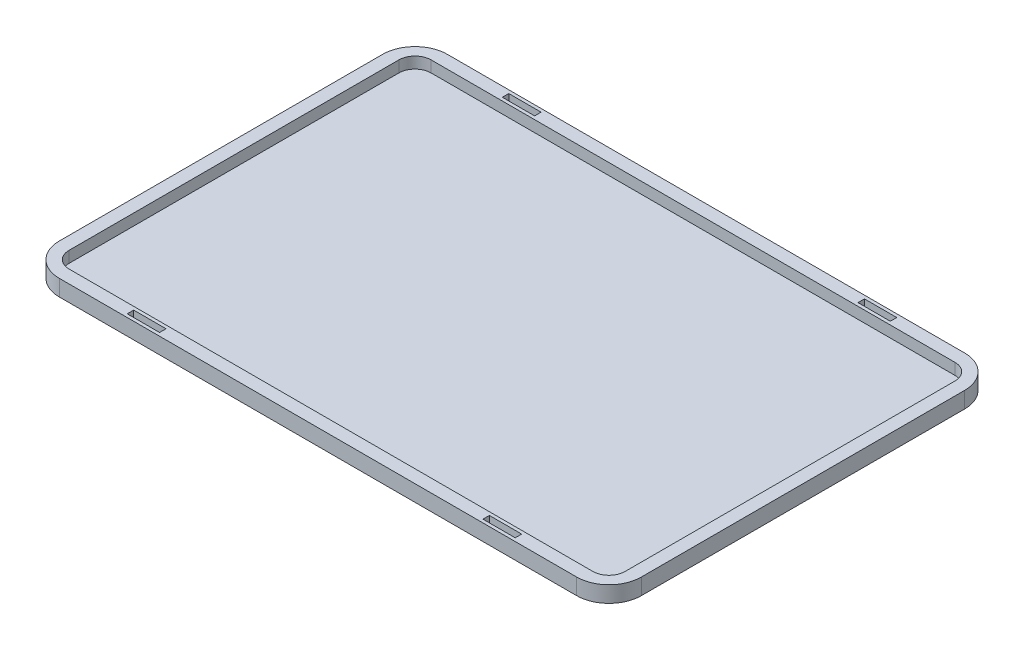
ISO-10303-21;
HEADER;
FILE_DESCRIPTION(('STEP AP214'),'2;1');
FILE_NAME('part.step','',(''),(''),'','','');
FILE_SCHEMA(('AUTOMOTIVE_DESIGN { 1 0 10303 214 1 1 1 1 }'));
ENDSEC;
DATA;
#1=APPLICATION_CONTEXT('core data for automotive mechanical design processes');
#2=APPLICATION_PROTOCOL_DEFINITION('international standard','automotive_design',2000,#1);
#3=PRODUCT_CONTEXT('',#1,'mechanical');
#4=PRODUCT('Part','Part','',(#3));
#5=PRODUCT_RELATED_PRODUCT_CATEGORY('part','',(#4));
#6=PRODUCT_DEFINITION_FORMATION('','',#4);
#7=PRODUCT_DEFINITION_CONTEXT('part definition',#1,'design');
#8=PRODUCT_DEFINITION('design','',#6,#7);
#9=PRODUCT_DEFINITION_SHAPE('','',#8);
#10=(LENGTH_UNIT() NAMED_UNIT(*) SI_UNIT(.MILLI.,.METRE.));
#11=(NAMED_UNIT(*) PLANE_ANGLE_UNIT() SI_UNIT($,.RADIAN.));
#12=(NAMED_UNIT(*) SI_UNIT($,.STERADIAN.) SOLID_ANGLE_UNIT());
#13=UNCERTAINTY_MEASURE_WITH_UNIT(LENGTH_MEASURE(1.E-05),#10,'distance_accuracy_value','');
#14=(GEOMETRIC_REPRESENTATION_CONTEXT(3) GLOBAL_UNCERTAINTY_ASSIGNED_CONTEXT((#13)) GLOBAL_UNIT_ASSIGNED_CONTEXT((#10,
#11,#12)) REPRESENTATION_CONTEXT('',''));
#15=CARTESIAN_POINT('',(0.,0.,0.));
#16=DIRECTION('',(0.,0.,1.));
#17=DIRECTION('',(1.,0.,0.));
#18=AXIS2_PLACEMENT_3D('',#15,#16,#17);
#19=CARTESIAN_POINT('',(0.,5.,0.));
#20=DIRECTION('',(0.,-1.,0.));
#21=DIRECTION('',(0.,0.,-1.));
#22=AXIS2_PLACEMENT_3D('',#19,#20,#21);
#23=PLANE('',#22);
#24=DIRECTION('',(0.,0.,1.));
#25=VECTOR('',#24,1.);
#26=CARTESIAN_POINT('',(50.,5.,0.));
#27=LINE('',#26,#25);
#28=CARTESIAN_POINT('',(50.,5.,57.));
#29=VERTEX_POINT('',#28);
#30=CARTESIAN_POINT('',(50.,5.,59.));
#31=VERTEX_POINT('',#30);
#32=EDGE_CURVE('E360',#29,#31,#27,.T.);
#33=ORIENTED_EDGE('',*,*,#32,.F.);
#34=DIRECTION('',(-1.,0.,0.));
#35=VECTOR('',#34,1.);
#36=CARTESIAN_POINT('',(0.,5.,57.));
#37=LINE('',#36,#35);
#38=CARTESIAN_POINT('',(60.,5.,57.));
#39=VERTEX_POINT('',#38);
#40=EDGE_CURVE('E354',#39,#29,#37,.T.);
#41=ORIENTED_EDGE('',*,*,#40,.F.);
#42=DIRECTION('',(0.,0.,-1.));
#43=VECTOR('',#42,1.);
#44=CARTESIAN_POINT('',(60.,5.,0.));
#45=LINE('',#44,#43);
#46=CARTESIAN_POINT('',(60.,5.,59.));
#47=VERTEX_POINT('',#46);
#48=EDGE_CURVE('E356',#47,#39,#45,.T.);
#49=ORIENTED_EDGE('',*,*,#48,.F.);
#50=DIRECTION('',(1.,0.,0.));
#51=VECTOR('',#50,1.);
#52=CARTESIAN_POINT('',(0.,5.,59.));
#53=LINE('',#52,#51);
#54=EDGE_CURVE('E358',#31,#47,#53,.T.);
#55=ORIENTED_EDGE('',*,*,#54,.F.);
#56=EDGE_LOOP('',(#33,#41,#49,#55));
#57=FACE_BOUND('',#56,.T.);
#58=DIRECTION('',(0.,0.,1.));
#59=VECTOR('',#58,1.);
#60=CARTESIAN_POINT('',(-60.,5.,0.));
#61=LINE('',#60,#59);
#62=CARTESIAN_POINT('',(-60.,5.,-59.));
#63=VERTEX_POINT('',#62);
#64=CARTESIAN_POINT('',(-60.,5.,-57.));
#65=VERTEX_POINT('',#64);
#66=EDGE_CURVE('E344',#63,#65,#61,.T.);
#67=ORIENTED_EDGE('',*,*,#66,.F.);
#68=DIRECTION('',(-1.,0.,0.));
#69=VECTOR('',#68,1.);
#70=CARTESIAN_POINT('',(0.,5.,-59.));
#71=LINE('',#70,#69);
#72=CARTESIAN_POINT('',(-50.,5.,-59.));
#73=VERTEX_POINT('',#72);
#74=EDGE_CURVE('E337',#73,#63,#71,.T.);
#75=ORIENTED_EDGE('',*,*,#74,.F.);
#76=DIRECTION('',(0.,0.,-1.));
#77=VECTOR('',#76,1.);
#78=CARTESIAN_POINT('',(-50.,5.,0.));
#79=LINE('',#78,#77);
#80=CARTESIAN_POINT('',(-50.,5.,-57.));
#81=VERTEX_POINT('',#80);
#82=EDGE_CURVE('E339',#81,#73,#79,.T.);
#83=ORIENTED_EDGE('',*,*,#82,.F.);
#84=DIRECTION('',(1.,0.,0.));
#85=VECTOR('',#84,1.);
#86=CARTESIAN_POINT('',(0.,5.,-57.));
#87=LINE('',#86,#85);
#88=EDGE_CURVE('E342',#65,#81,#87,.T.);
#89=ORIENTED_EDGE('',*,*,#88,.F.);
#90=EDGE_LOOP('',(#67,#75,#83,#89));
#91=FACE_BOUND('',#90,.T.);
#92=DIRECTION('',(0.,0.,-1.));
#93=VECTOR('',#92,1.);
#94=CARTESIAN_POINT('',(86.,5.,0.));
#95=LINE('',#94,#93);
#96=CARTESIAN_POINT('',(86.,5.,51.));
#97=VERTEX_POINT('',#96);
#98=CARTESIAN_POINT('',(86.,5.,-51.));
#99=VERTEX_POINT('',#98);
#100=EDGE_CURVE('E380',#97,#99,#95,.T.);
#101=ORIENTED_EDGE('',*,*,#100,.F.);
#102=CARTESIAN_POINT('',(81.,5.,51.));
#103=DIRECTION('',(0.,-1.,0.));
#104=DIRECTION('',(0.,0.,-1.));
#105=AXIS2_PLACEMENT_3D('',#102,#103,#104);
#106=CIRCLE('',#105,5.);
#107=CARTESIAN_POINT('',(81.,5.,56.));
#108=VERTEX_POINT('',#107);
#109=EDGE_CURVE('E11',#108,#97,#106,.F.);
#110=ORIENTED_EDGE('',*,*,#109,.F.);
#111=DIRECTION('',(1.,0.,0.));
#112=VECTOR('',#111,1.);
#113=CARTESIAN_POINT('',(0.,5.,56.));
#114=LINE('',#113,#112);
#115=CARTESIAN_POINT('',(-81.,5.,56.));
#116=VERTEX_POINT('',#115);
#117=EDGE_CURVE('E384',#116,#108,#114,.T.);
#118=ORIENTED_EDGE('',*,*,#117,.F.);
#119=CARTESIAN_POINT('',(-81.,5.,51.));
#120=DIRECTION('',(0.,-1.,0.));
#121=DIRECTION('',(0.,0.,-1.));
#122=AXIS2_PLACEMENT_3D('',#119,#120,#121);
#123=CIRCLE('',#122,5.);
#124=CARTESIAN_POINT('',(-86.,5.,51.));
#125=VERTEX_POINT('',#124);
#126=EDGE_CURVE('E481',#125,#116,#123,.F.);
#127=ORIENTED_EDGE('',*,*,#126,.F.);
#128=DIRECTION('',(0.,0.,1.));
#129=VECTOR('',#128,1.);
#130=CARTESIAN_POINT('',(-86.,5.,0.));
#131=LINE('',#130,#129);
#132=CARTESIAN_POINT('',(-86.,5.,-51.));
#133=VERTEX_POINT('',#132);
#134=EDGE_CURVE('E381',#133,#125,#131,.T.);
#135=ORIENTED_EDGE('',*,*,#134,.F.);
#136=CARTESIAN_POINT('',(-81.,5.,-51.));
#137=DIRECTION('',(0.,-1.,0.));
#138=DIRECTION('',(0.,0.,-1.));
#139=AXIS2_PLACEMENT_3D('',#136,#137,#138);
#140=CIRCLE('',#139,5.);
#141=CARTESIAN_POINT('',(-81.,5.,-56.));
#142=VERTEX_POINT('',#141);
#143=EDGE_CURVE('E461',#142,#133,#140,.F.);
#144=ORIENTED_EDGE('',*,*,#143,.F.);
#145=DIRECTION('',(-1.,0.,0.));
#146=VECTOR('',#145,1.);
#147=CARTESIAN_POINT('',(0.,5.,-56.));
#148=LINE('',#147,#146);
#149=CARTESIAN_POINT('',(81.,5.,-56.));
#150=VERTEX_POINT('',#149);
#151=EDGE_CURVE('E385',#150,#142,#148,.T.);
#152=ORIENTED_EDGE('',*,*,#151,.F.);
#153=CARTESIAN_POINT('',(81.,5.,-51.));
#154=DIRECTION('',(0.,-1.,0.));
#155=DIRECTION('',(0.,0.,-1.));
#156=AXIS2_PLACEMENT_3D('',#153,#154,#155);
#157=CIRCLE('',#156,5.);
#158=EDGE_CURVE('E471',#99,#150,#157,.F.);
#159=ORIENTED_EDGE('',*,*,#158,.F.);
#160=EDGE_LOOP('',(#101,#110,#118,#127,#135,#144,#152,#159));
#161=FACE_BOUND('',#160,.T.);
#162=DIRECTION('',(-1.,0.,0.));
#163=VECTOR('',#162,1.);
#164=CARTESIAN_POINT('',(-90.,5.,-60.));
#165=LINE('',#164,#163);
#166=CARTESIAN_POINT('',(79.9999999999999,5.,-60.));
#167=VERTEX_POINT('',#166);
#168=CARTESIAN_POINT('',(-80.,5.,-60.));
#169=VERTEX_POINT('',#168);
#170=EDGE_CURVE('E394',#167,#169,#165,.T.);
#171=ORIENTED_EDGE('',*,*,#170,.T.);
#172=CARTESIAN_POINT('',(-80.,5.,-50.));
#173=DIRECTION('',(0.,-1.,0.));
#174=DIRECTION('',(0.,0.,-1.));
#175=AXIS2_PLACEMENT_3D('',#172,#173,#174);
#176=CIRCLE('',#175,10.);
#177=CARTESIAN_POINT('',(-90.,5.,-50.));
#178=VERTEX_POINT('',#177);
#179=EDGE_CURVE('E449',#169,#178,#176,.F.);
#180=ORIENTED_EDGE('',*,*,#179,.T.);
#181=DIRECTION('',(0.,0.,1.));
#182=VECTOR('',#181,1.);
#183=CARTESIAN_POINT('',(-90.,5.,60.));
#184=LINE('',#183,#182);
#185=CARTESIAN_POINT('',(-90.,5.,50.));
#186=VERTEX_POINT('',#185);
#187=EDGE_CURVE('E398',#178,#186,#184,.T.);
#188=ORIENTED_EDGE('',*,*,#187,.T.);
#189=CARTESIAN_POINT('',(-80.,5.,50.));
#190=DIRECTION('',(0.,-1.,0.));
#191=DIRECTION('',(0.,0.,-1.));
#192=AXIS2_PLACEMENT_3D('',#189,#190,#191);
#193=CIRCLE('',#192,10.);
#194=CARTESIAN_POINT('',(-80.,5.,60.));
#195=VERTEX_POINT('',#194);
#196=EDGE_CURVE('E418',#186,#195,#193,.F.);
#197=ORIENTED_EDGE('',*,*,#196,.T.);
#198=DIRECTION('',(1.,0.,0.));
#199=VECTOR('',#198,1.);
#200=CARTESIAN_POINT('',(-90.,5.,60.));
#201=LINE('',#200,#199);
#202=CARTESIAN_POINT('',(79.9999999999999,5.,60.));
#203=VERTEX_POINT('',#202);
#204=EDGE_CURVE('E400',#195,#203,#201,.T.);
#205=ORIENTED_EDGE('',*,*,#204,.T.);
#206=CARTESIAN_POINT('',(80.,5.,50.));
#207=DIRECTION('',(0.,-1.,0.));
#208=DIRECTION('',(0.,0.,-1.));
#209=AXIS2_PLACEMENT_3D('',#206,#207,#208);
#210=CIRCLE('',#209,10.);
#211=CARTESIAN_POINT('',(90.,5.,50.));
#212=VERTEX_POINT('',#211);
#213=EDGE_CURVE('E429',#203,#212,#210,.F.);
#214=ORIENTED_EDGE('',*,*,#213,.T.);
#215=DIRECTION('',(0.,0.,-1.));
#216=VECTOR('',#215,1.);
#217=CARTESIAN_POINT('',(90.,5.,60.));
#218=LINE('',#217,#216);
#219=CARTESIAN_POINT('',(90.,5.,-50.));
#220=VERTEX_POINT('',#219);
#221=EDGE_CURVE('E391',#212,#220,#218,.T.);
#222=ORIENTED_EDGE('',*,*,#221,.T.);
#223=CARTESIAN_POINT('',(80.,5.,-50.));
#224=DIRECTION('',(0.,-1.,0.));
#225=DIRECTION('',(0.,0.,-1.));
#226=AXIS2_PLACEMENT_3D('',#223,#224,#225);
#227=CIRCLE('',#226,10.);
#228=EDGE_CURVE('E439',#220,#167,#227,.F.);
#229=ORIENTED_EDGE('',*,*,#228,.T.);
#230=EDGE_LOOP('',(#171,#180,#188,#197,#205,#214,#222,#229));
#231=FACE_BOUND('',#230,.T.);
#232=DIRECTION('',(0.,0.,1.));
#233=VECTOR('',#232,1.);
#234=CARTESIAN_POINT('',(50.,5.,0.));
#235=LINE('',#234,#233);
#236=CARTESIAN_POINT('',(50.,5.,-59.));
#237=VERTEX_POINT('',#236);
#238=CARTESIAN_POINT('',(50.,5.,-57.));
#239=VERTEX_POINT('',#238);
#240=EDGE_CURVE('E248',#237,#239,#235,.T.);
#241=ORIENTED_EDGE('',*,*,#240,.F.);
#242=DIRECTION('',(-1.,0.,0.));
#243=VECTOR('',#242,1.);
#244=CARTESIAN_POINT('',(0.,5.,-59.));
#245=LINE('',#244,#243);
#246=CARTESIAN_POINT('',(60.,5.,-59.));
#247=VERTEX_POINT('',#246);
#248=EDGE_CURVE('E346',#247,#237,#245,.T.);
#249=ORIENTED_EDGE('',*,*,#248,.F.);
#250=DIRECTION('',(0.,0.,-1.));
#251=VECTOR('',#250,1.);
#252=CARTESIAN_POINT('',(60.,5.,0.));
#253=LINE('',#252,#251);
#254=CARTESIAN_POINT('',(60.,5.,-57.));
#255=VERTEX_POINT('',#254);
#256=EDGE_CURVE('E348',#255,#247,#253,.T.);
#257=ORIENTED_EDGE('',*,*,#256,.F.);
#258=DIRECTION('',(1.,0.,0.));
#259=VECTOR('',#258,1.);
#260=CARTESIAN_POINT('',(0.,5.,-57.));
#261=LINE('',#260,#259);
#262=EDGE_CURVE('E351',#239,#255,#261,.T.);
#263=ORIENTED_EDGE('',*,*,#262,.F.);
#264=EDGE_LOOP('',(#241,#249,#257,#263));
#265=FACE_BOUND('',#264,.T.);
#266=DIRECTION('',(0.,0.,1.));
#267=VECTOR('',#266,1.);
#268=CARTESIAN_POINT('',(-60.,5.,0.));
#269=LINE('',#268,#267);
#270=CARTESIAN_POINT('',(-60.,5.,57.));
#271=VERTEX_POINT('',#270);
#272=CARTESIAN_POINT('',(-60.,5.,59.));
#273=VERTEX_POINT('',#272);
#274=EDGE_CURVE('E368',#271,#273,#269,.T.);
#275=ORIENTED_EDGE('',*,*,#274,.F.);
#276=DIRECTION('',(-1.,0.,0.));
#277=VECTOR('',#276,1.);
#278=CARTESIAN_POINT('',(0.,5.,57.));
#279=LINE('',#278,#277);
#280=CARTESIAN_POINT('',(-50.,5.,57.));
#281=VERTEX_POINT('',#280);
#282=EDGE_CURVE('E362',#281,#271,#279,.T.);
#283=ORIENTED_EDGE('',*,*,#282,.F.);
#284=DIRECTION('',(0.,0.,-1.));
#285=VECTOR('',#284,1.);
#286=CARTESIAN_POINT('',(-50.,5.,0.));
#287=LINE('',#286,#285);
#288=CARTESIAN_POINT('',(-50.,5.,59.));
#289=VERTEX_POINT('',#288);
#290=EDGE_CURVE('E364',#289,#281,#287,.T.);
#291=ORIENTED_EDGE('',*,*,#290,.F.);
#292=DIRECTION('',(1.,0.,0.));
#293=VECTOR('',#292,1.);
#294=CARTESIAN_POINT('',(0.,5.,59.));
#295=LINE('',#294,#293);
#296=EDGE_CURVE('E366',#273,#289,#295,.T.);
#297=ORIENTED_EDGE('',*,*,#296,.F.);
#298=EDGE_LOOP('',(#275,#283,#291,#297));
#299=FACE_BOUND('',#298,.T.);
#300=ADVANCED_FACE('F33',(#57,#91,#161,#231,#265,#299),#23,.F.);
#301=CARTESIAN_POINT('',(0.,0.,0.));
#302=DIRECTION('',(0.,-1.,0.));
#303=DIRECTION('',(0.,0.,-1.));
#304=AXIS2_PLACEMENT_3D('',#301,#302,#303);
#305=PLANE('',#304);
#306=DIRECTION('',(0.,0.,1.));
#307=VECTOR('',#306,1.);
#308=CARTESIAN_POINT('',(-90.,0.,60.));
#309=LINE('',#308,#307);
#310=CARTESIAN_POINT('',(-90.,0.,-50.));
#311=VERTEX_POINT('',#310);
#312=CARTESIAN_POINT('',(-90.,0.,50.));
#313=VERTEX_POINT('',#312);
#314=EDGE_CURVE('E409',#311,#313,#309,.T.);
#315=ORIENTED_EDGE('',*,*,#314,.F.);
#316=CARTESIAN_POINT('',(-80.,0.,-50.));
#317=DIRECTION('',(0.,-1.,0.));
#318=DIRECTION('',(0.,0.,-1.));
#319=AXIS2_PLACEMENT_3D('',#316,#317,#318);
#320=CIRCLE('',#319,10.);
#321=CARTESIAN_POINT('',(-80.,0.,-60.));
#322=VERTEX_POINT('',#321);
#323=EDGE_CURVE('E451',#311,#322,#320,.T.);
#324=ORIENTED_EDGE('',*,*,#323,.T.);
#325=DIRECTION('',(-1.,0.,0.));
#326=VECTOR('',#325,1.);
#327=CARTESIAN_POINT('',(-90.,0.,-60.));
#328=LINE('',#327,#326);
#329=CARTESIAN_POINT('',(79.9999999999999,0.,-60.));
#330=VERTEX_POINT('',#329);
#331=EDGE_CURVE('E406',#330,#322,#328,.T.);
#332=ORIENTED_EDGE('',*,*,#331,.F.);
#333=CARTESIAN_POINT('',(80.,0.,-50.));
#334=DIRECTION('',(0.,-1.,0.));
#335=DIRECTION('',(0.,0.,-1.));
#336=AXIS2_PLACEMENT_3D('',#333,#334,#335);
#337=CIRCLE('',#336,10.);
#338=CARTESIAN_POINT('',(90.,0.,-50.));
#339=VERTEX_POINT('',#338);
#340=EDGE_CURVE('E441',#330,#339,#337,.T.);
#341=ORIENTED_EDGE('',*,*,#340,.T.);
#342=DIRECTION('',(0.,0.,-1.));
#343=VECTOR('',#342,1.);
#344=CARTESIAN_POINT('',(90.,0.,60.));
#345=LINE('',#344,#343);
#346=CARTESIAN_POINT('',(90.,0.,50.));
#347=VERTEX_POINT('',#346);
#348=EDGE_CURVE('E388',#347,#339,#345,.T.);
#349=ORIENTED_EDGE('',*,*,#348,.F.);
#350=CARTESIAN_POINT('',(80.,0.,50.));
#351=DIRECTION('',(0.,-1.,0.));
#352=DIRECTION('',(0.,0.,-1.));
#353=AXIS2_PLACEMENT_3D('',#350,#351,#352);
#354=CIRCLE('',#353,10.);
#355=CARTESIAN_POINT('',(79.9999999999999,0.,60.));
#356=VERTEX_POINT('',#355);
#357=EDGE_CURVE('E431',#347,#356,#354,.T.);
#358=ORIENTED_EDGE('',*,*,#357,.T.);
#359=DIRECTION('',(1.,0.,0.));
#360=VECTOR('',#359,1.);
#361=CARTESIAN_POINT('',(-90.,0.,60.));
#362=LINE('',#361,#360);
#363=CARTESIAN_POINT('',(-80.,0.,60.));
#364=VERTEX_POINT('',#363);
#365=EDGE_CURVE('E395',#364,#356,#362,.T.);
#366=ORIENTED_EDGE('',*,*,#365,.F.);
#367=CARTESIAN_POINT('',(-80.,0.,50.));
#368=DIRECTION('',(0.,-1.,0.));
#369=DIRECTION('',(0.,0.,-1.));
#370=AXIS2_PLACEMENT_3D('',#367,#368,#369);
#371=CIRCLE('',#370,10.);
#372=EDGE_CURVE('E420',#364,#313,#371,.T.);
#373=ORIENTED_EDGE('',*,*,#372,.T.);
#374=EDGE_LOOP('',(#315,#324,#332,#341,#349,#358,#366,#373));
#375=FACE_BOUND('',#374,.T.);
#376=DIRECTION('',(-1.,0.,0.));
#377=VECTOR('',#376,1.);
#378=CARTESIAN_POINT('',(-60.,0.,-59.));
#379=LINE('',#378,#377);
#380=CARTESIAN_POINT('',(-50.,0.,-59.));
#381=VERTEX_POINT('',#380);
#382=CARTESIAN_POINT('',(-60.,0.,-59.));
#383=VERTEX_POINT('',#382);
#384=EDGE_CURVE('E325',#381,#383,#379,.T.);
#385=ORIENTED_EDGE('',*,*,#384,.T.);
#386=DIRECTION('',(0.,0.,1.));
#387=VECTOR('',#386,1.);
#388=CARTESIAN_POINT('',(-60.,0.,-59.));
#389=LINE('',#388,#387);
#390=CARTESIAN_POINT('',(-60.,0.,-57.));
#391=VERTEX_POINT('',#390);
#392=EDGE_CURVE('E251',#383,#391,#389,.T.);
#393=ORIENTED_EDGE('',*,*,#392,.T.);
#394=DIRECTION('',(1.,0.,0.));
#395=VECTOR('',#394,1.);
#396=CARTESIAN_POINT('',(-60.,0.,-57.));
#397=LINE('',#396,#395);
#398=CARTESIAN_POINT('',(-50.,0.,-57.));
#399=VERTEX_POINT('',#398);
#400=EDGE_CURVE('E319',#391,#399,#397,.T.);
#401=ORIENTED_EDGE('',*,*,#400,.T.);
#402=DIRECTION('',(0.,0.,-1.));
#403=VECTOR('',#402,1.);
#404=CARTESIAN_POINT('',(-50.,0.,-59.));
#405=LINE('',#404,#403);
#406=EDGE_CURVE('E322',#399,#381,#405,.T.);
#407=ORIENTED_EDGE('',*,*,#406,.T.);
#408=EDGE_LOOP('',(#385,#393,#401,#407));
#409=FACE_BOUND('',#408,.T.);
#410=DIRECTION('',(-1.,0.,0.));
#411=VECTOR('',#410,1.);
#412=CARTESIAN_POINT('',(50.,0.,-59.));
#413=LINE('',#412,#411);
#414=CARTESIAN_POINT('',(60.,0.,-59.));
#415=VERTEX_POINT('',#414);
#416=CARTESIAN_POINT('',(50.,0.,-59.));
#417=VERTEX_POINT('',#416);
#418=EDGE_CURVE('E267',#415,#417,#413,.T.);
#419=ORIENTED_EDGE('',*,*,#418,.T.);
#420=DIRECTION('',(0.,0.,1.));
#421=VECTOR('',#420,1.);
#422=CARTESIAN_POINT('',(50.,0.,-59.));
#423=LINE('',#422,#421);
#424=CARTESIAN_POINT('',(50.,0.,-57.));
#425=VERTEX_POINT('',#424);
#426=EDGE_CURVE('E245',#417,#425,#423,.T.);
#427=ORIENTED_EDGE('',*,*,#426,.T.);
#428=DIRECTION('',(1.,0.,0.));
#429=VECTOR('',#428,1.);
#430=CARTESIAN_POINT('',(50.,0.,-57.));
#431=LINE('',#430,#429);
#432=CARTESIAN_POINT('',(60.,0.,-57.));
#433=VERTEX_POINT('',#432);
#434=EDGE_CURVE('E255',#425,#433,#431,.T.);
#435=ORIENTED_EDGE('',*,*,#434,.T.);
#436=DIRECTION('',(0.,0.,-1.));
#437=VECTOR('',#436,1.);
#438=CARTESIAN_POINT('',(60.,0.,-59.));
#439=LINE('',#438,#437);
#440=EDGE_CURVE('E261',#433,#415,#439,.T.);
#441=ORIENTED_EDGE('',*,*,#440,.T.);
#442=EDGE_LOOP('',(#419,#427,#435,#441));
#443=FACE_BOUND('',#442,.T.);
#444=DIRECTION('',(-1.,0.,0.));
#445=VECTOR('',#444,1.);
#446=CARTESIAN_POINT('',(50.,0.,57.));
#447=LINE('',#446,#445);
#448=CARTESIAN_POINT('',(60.,0.,57.));
#449=VERTEX_POINT('',#448);
#450=CARTESIAN_POINT('',(50.,0.,57.));
#451=VERTEX_POINT('',#450);
#452=EDGE_CURVE('E290',#449,#451,#447,.T.);
#453=ORIENTED_EDGE('',*,*,#452,.T.);
#454=DIRECTION('',(0.,0.,1.));
#455=VECTOR('',#454,1.);
#456=CARTESIAN_POINT('',(50.,0.,57.));
#457=LINE('',#456,#455);
#458=CARTESIAN_POINT('',(50.,0.,59.));
#459=VERTEX_POINT('',#458);
#460=EDGE_CURVE('E280',#451,#459,#457,.T.);
#461=ORIENTED_EDGE('',*,*,#460,.T.);
#462=DIRECTION('',(1.,0.,0.));
#463=VECTOR('',#462,1.);
#464=CARTESIAN_POINT('',(50.,0.,59.));
#465=LINE('',#464,#463);
#466=CARTESIAN_POINT('',(60.,0.,59.));
#467=VERTEX_POINT('',#466);
#468=EDGE_CURVE('E283',#459,#467,#465,.T.);
#469=ORIENTED_EDGE('',*,*,#468,.T.);
#470=DIRECTION('',(0.,0.,-1.));
#471=VECTOR('',#470,1.);
#472=CARTESIAN_POINT('',(60.,0.,57.));
#473=LINE('',#472,#471);
#474=EDGE_CURVE('E287',#467,#449,#473,.T.);
#475=ORIENTED_EDGE('',*,*,#474,.T.);
#476=EDGE_LOOP('',(#453,#461,#469,#475));
#477=FACE_BOUND('',#476,.T.);
#478=DIRECTION('',(-1.,0.,0.));
#479=VECTOR('',#478,1.);
#480=CARTESIAN_POINT('',(-60.,0.,57.));
#481=LINE('',#480,#479);
#482=CARTESIAN_POINT('',(-50.,0.,57.));
#483=VERTEX_POINT('',#482);
#484=CARTESIAN_POINT('',(-60.,0.,57.));
#485=VERTEX_POINT('',#484);
#486=EDGE_CURVE('E307',#483,#485,#481,.T.);
#487=ORIENTED_EDGE('',*,*,#486,.T.);
#488=DIRECTION('',(0.,0.,1.));
#489=VECTOR('',#488,1.);
#490=CARTESIAN_POINT('',(-60.,0.,57.));
#491=LINE('',#490,#489);
#492=CARTESIAN_POINT('',(-60.,0.,59.));
#493=VERTEX_POINT('',#492);
#494=EDGE_CURVE('E298',#485,#493,#491,.T.);
#495=ORIENTED_EDGE('',*,*,#494,.T.);
#496=DIRECTION('',(1.,0.,0.));
#497=VECTOR('',#496,1.);
#498=CARTESIAN_POINT('',(-60.,0.,59.));
#499=LINE('',#498,#497);
#500=CARTESIAN_POINT('',(-50.,0.,59.));
#501=VERTEX_POINT('',#500);
#502=EDGE_CURVE('E301',#493,#501,#499,.T.);
#503=ORIENTED_EDGE('',*,*,#502,.T.);
#504=DIRECTION('',(0.,0.,-1.));
#505=VECTOR('',#504,1.);
#506=CARTESIAN_POINT('',(-50.,0.,57.));
#507=LINE('',#506,#505);
#508=EDGE_CURVE('E304',#501,#483,#507,.T.);
#509=ORIENTED_EDGE('',*,*,#508,.T.);
#510=EDGE_LOOP('',(#487,#495,#503,#509));
#511=FACE_BOUND('',#510,.T.);
#512=ADVANCED_FACE('F264',(#375,#409,#443,#477,#511),#305,.T.);
#513=CARTESIAN_POINT('',(81.,5.,51.));
#514=DIRECTION('',(0.,1.,0.));
#515=DIRECTION('',(0.,0.,1.));
#516=AXIS2_PLACEMENT_3D('',#513,#514,#515);
#517=CYLINDRICAL_SURFACE('',#516,5.);
#518=DIRECTION('',(0.,-1.,0.));
#519=VECTOR('',#518,1.);
#520=CARTESIAN_POINT('',(81.,5.,56.));
#521=LINE('',#520,#519);
#522=CARTESIAN_POINT('',(81.,1.5,56.));
#523=VERTEX_POINT('',#522);
#524=EDGE_CURVE('E483',#108,#523,#521,.T.);
#525=ORIENTED_EDGE('',*,*,#524,.F.);
#526=ORIENTED_EDGE('',*,*,#109,.T.);
#527=DIRECTION('',(0.,-1.,0.));
#528=VECTOR('',#527,1.);
#529=CARTESIAN_POINT('',(86.,5.,51.));
#530=LINE('',#529,#528);
#531=CARTESIAN_POINT('',(86.,1.5,51.));
#532=VERTEX_POINT('',#531);
#533=EDGE_CURVE('E486',#532,#97,#530,.F.);
#534=ORIENTED_EDGE('',*,*,#533,.F.);
#535=CARTESIAN_POINT('',(81.,1.5,51.));
#536=DIRECTION('',(0.,-1.,0.));
#537=DIRECTION('',(0.,0.,-1.));
#538=AXIS2_PLACEMENT_3D('',#535,#536,#537);
#539=CIRCLE('',#538,5.);
#540=EDGE_CURVE('E41',#523,#532,#539,.F.);
#541=ORIENTED_EDGE('',*,*,#540,.F.);
#542=EDGE_LOOP('',(#525,#526,#534,#541));
#543=FACE_BOUND('',#542,.T.);
#544=ADVANCED_FACE('F35',(#543),#517,.F.);
#545=CARTESIAN_POINT('',(-81.,5.,51.));
#546=DIRECTION('',(0.,1.,0.));
#547=DIRECTION('',(0.,0.,1.));
#548=AXIS2_PLACEMENT_3D('',#545,#546,#547);
#549=CYLINDRICAL_SURFACE('',#548,5.);
#550=DIRECTION('',(0.,-1.,0.));
#551=VECTOR('',#550,1.);
#552=CARTESIAN_POINT('',(-86.,5.,51.));
#553=LINE('',#552,#551);
#554=CARTESIAN_POINT('',(-86.,1.5,51.));
#555=VERTEX_POINT('',#554);
#556=EDGE_CURVE('E473',#125,#555,#553,.T.);
#557=ORIENTED_EDGE('',*,*,#556,.F.);
#558=ORIENTED_EDGE('',*,*,#126,.T.);
#559=DIRECTION('',(0.,-1.,0.));
#560=VECTOR('',#559,1.);
#561=CARTESIAN_POINT('',(-81.,5.,56.));
#562=LINE('',#561,#560);
#563=CARTESIAN_POINT('',(-81.,1.5,56.));
#564=VERTEX_POINT('',#563);
#565=EDGE_CURVE('E476',#564,#116,#562,.F.);
#566=ORIENTED_EDGE('',*,*,#565,.F.);
#567=CARTESIAN_POINT('',(-81.,1.5,51.));
#568=DIRECTION('',(0.,-1.,0.));
#569=DIRECTION('',(0.,0.,-1.));
#570=AXIS2_PLACEMENT_3D('',#567,#568,#569);
#571=CIRCLE('',#570,5.);
#572=EDGE_CURVE('E479',#555,#564,#571,.F.);
#573=ORIENTED_EDGE('',*,*,#572,.F.);
#574=EDGE_LOOP('',(#557,#558,#566,#573));
#575=FACE_BOUND('',#574,.T.);
#576=ADVANCED_FACE('F523',(#575),#549,.F.);
#577=CARTESIAN_POINT('',(81.,5.,-51.));
#578=DIRECTION('',(0.,1.,0.));
#579=DIRECTION('',(0.,0.,1.));
#580=AXIS2_PLACEMENT_3D('',#577,#578,#579);
#581=CYLINDRICAL_SURFACE('',#580,5.);
#582=DIRECTION('',(0.,-1.,0.));
#583=VECTOR('',#582,1.);
#584=CARTESIAN_POINT('',(86.,5.,-51.));
#585=LINE('',#584,#583);
#586=CARTESIAN_POINT('',(86.,1.5,-51.));
#587=VERTEX_POINT('',#586);
#588=EDGE_CURVE('E463',#99,#587,#585,.T.);
#589=ORIENTED_EDGE('',*,*,#588,.F.);
#590=ORIENTED_EDGE('',*,*,#158,.T.);
#591=DIRECTION('',(0.,-1.,0.));
#592=VECTOR('',#591,1.);
#593=CARTESIAN_POINT('',(81.,5.,-56.));
#594=LINE('',#593,#592);
#595=CARTESIAN_POINT('',(81.,1.5,-56.));
#596=VERTEX_POINT('',#595);
#597=EDGE_CURVE('E466',#596,#150,#594,.F.);
#598=ORIENTED_EDGE('',*,*,#597,.F.);
#599=CARTESIAN_POINT('',(81.,1.5,-51.));
#600=DIRECTION('',(0.,-1.,0.));
#601=DIRECTION('',(0.,0.,-1.));
#602=AXIS2_PLACEMENT_3D('',#599,#600,#601);
#603=CIRCLE('',#602,5.);
#604=EDGE_CURVE('E469',#587,#596,#603,.F.);
#605=ORIENTED_EDGE('',*,*,#604,.F.);
#606=EDGE_LOOP('',(#589,#590,#598,#605));
#607=FACE_BOUND('',#606,.T.);
#608=ADVANCED_FACE('F502',(#607),#581,.F.);
#609=CARTESIAN_POINT('',(-81.,5.,-51.));
#610=DIRECTION('',(0.,1.,0.));
#611=DIRECTION('',(0.,0.,1.));
#612=AXIS2_PLACEMENT_3D('',#609,#610,#611);
#613=CYLINDRICAL_SURFACE('',#612,5.);
#614=DIRECTION('',(0.,-1.,0.));
#615=VECTOR('',#614,1.);
#616=CARTESIAN_POINT('',(-81.,5.,-56.));
#617=LINE('',#616,#615);
#618=CARTESIAN_POINT('',(-81.,1.5,-56.));
#619=VERTEX_POINT('',#618);
#620=EDGE_CURVE('E453',#142,#619,#617,.T.);
#621=ORIENTED_EDGE('',*,*,#620,.F.);
#622=ORIENTED_EDGE('',*,*,#143,.T.);
#623=DIRECTION('',(0.,-1.,0.));
#624=VECTOR('',#623,1.);
#625=CARTESIAN_POINT('',(-86.,5.,-51.));
#626=LINE('',#625,#624);
#627=CARTESIAN_POINT('',(-86.,1.5,-51.));
#628=VERTEX_POINT('',#627);
#629=EDGE_CURVE('E456',#628,#133,#626,.F.);
#630=ORIENTED_EDGE('',*,*,#629,.F.);
#631=CARTESIAN_POINT('',(-81.,1.5,-51.));
#632=DIRECTION('',(0.,-1.,0.));
#633=DIRECTION('',(0.,0.,-1.));
#634=AXIS2_PLACEMENT_3D('',#631,#632,#633);
#635=CIRCLE('',#634,5.);
#636=EDGE_CURVE('E459',#619,#628,#635,.F.);
#637=ORIENTED_EDGE('',*,*,#636,.F.);
#638=EDGE_LOOP('',(#621,#622,#630,#637));
#639=FACE_BOUND('',#638,.T.);
#640=ADVANCED_FACE('F510',(#639),#613,.F.);
#641=CARTESIAN_POINT('',(-80.,5.,-50.));
#642=DIRECTION('',(0.,-1.,0.));
#643=DIRECTION('',(0.,0.,-1.));
#644=AXIS2_PLACEMENT_3D('',#641,#642,#643);
#645=CYLINDRICAL_SURFACE('',#644,10.);
#646=DIRECTION('',(0.,-1.,0.));
#647=VECTOR('',#646,1.);
#648=CARTESIAN_POINT('',(-90.,5.,-50.));
#649=LINE('',#648,#647);
#650=EDGE_CURVE('E443',#178,#311,#649,.T.);
#651=ORIENTED_EDGE('',*,*,#650,.F.);
#652=ORIENTED_EDGE('',*,*,#179,.F.);
#653=DIRECTION('',(0.,-1.,0.));
#654=VECTOR('',#653,1.);
#655=CARTESIAN_POINT('',(-80.,5.,-60.));
#656=LINE('',#655,#654);
#657=EDGE_CURVE('E446',#322,#169,#656,.F.);
#658=ORIENTED_EDGE('',*,*,#657,.F.);
#659=ORIENTED_EDGE('',*,*,#323,.F.);
#660=EDGE_LOOP('',(#651,#652,#658,#659));
#661=FACE_BOUND('',#660,.T.);
#662=ADVANCED_FACE('F574',(#661),#645,.T.);
#663=CARTESIAN_POINT('',(80.,5.,-50.));
#664=DIRECTION('',(0.,-1.,0.));
#665=DIRECTION('',(0.,0.,-1.));
#666=AXIS2_PLACEMENT_3D('',#663,#664,#665);
#667=CYLINDRICAL_SURFACE('',#666,10.);
#668=DIRECTION('',(0.,-1.,0.));
#669=VECTOR('',#668,1.);
#670=CARTESIAN_POINT('',(80.,5.,-60.));
#671=LINE('',#670,#669);
#672=EDGE_CURVE('E433',#167,#330,#671,.T.);
#673=ORIENTED_EDGE('',*,*,#672,.F.);
#674=ORIENTED_EDGE('',*,*,#228,.F.);
#675=DIRECTION('',(0.,-1.,0.));
#676=VECTOR('',#675,1.);
#677=CARTESIAN_POINT('',(90.,5.,-50.));
#678=LINE('',#677,#676);
#679=EDGE_CURVE('E436',#339,#220,#678,.F.);
#680=ORIENTED_EDGE('',*,*,#679,.F.);
#681=ORIENTED_EDGE('',*,*,#340,.F.);
#682=EDGE_LOOP('',(#673,#674,#680,#681));
#683=FACE_BOUND('',#682,.T.);
#684=ADVANCED_FACE('F570',(#683),#667,.T.);
#685=CARTESIAN_POINT('',(80.,5.,50.));
#686=DIRECTION('',(0.,-1.,0.));
#687=DIRECTION('',(0.,0.,-1.));
#688=AXIS2_PLACEMENT_3D('',#685,#686,#687);
#689=CYLINDRICAL_SURFACE('',#688,10.);
#690=DIRECTION('',(0.,-1.,0.));
#691=VECTOR('',#690,1.);
#692=CARTESIAN_POINT('',(90.,5.,50.));
#693=LINE('',#692,#691);
#694=EDGE_CURVE('E423',#212,#347,#693,.T.);
#695=ORIENTED_EDGE('',*,*,#694,.F.);
#696=ORIENTED_EDGE('',*,*,#213,.F.);
#697=DIRECTION('',(0.,-1.,0.));
#698=VECTOR('',#697,1.);
#699=CARTESIAN_POINT('',(80.,5.,60.));
#700=LINE('',#699,#698);
#701=EDGE_CURVE('E426',#356,#203,#700,.F.);
#702=ORIENTED_EDGE('',*,*,#701,.F.);
#703=ORIENTED_EDGE('',*,*,#357,.F.);
#704=EDGE_LOOP('',(#695,#696,#702,#703));
#705=FACE_BOUND('',#704,.T.);
#706=ADVANCED_FACE('F566',(#705),#689,.T.);
#707=CARTESIAN_POINT('',(-80.,5.,50.));
#708=DIRECTION('',(0.,-1.,0.));
#709=DIRECTION('',(0.,0.,-1.));
#710=AXIS2_PLACEMENT_3D('',#707,#708,#709);
#711=CYLINDRICAL_SURFACE('',#710,10.);
#712=DIRECTION('',(0.,-1.,0.));
#713=VECTOR('',#712,1.);
#714=CARTESIAN_POINT('',(-80.,5.,60.));
#715=LINE('',#714,#713);
#716=EDGE_CURVE('E403',#195,#364,#715,.T.);
#717=ORIENTED_EDGE('',*,*,#716,.F.);
#718=ORIENTED_EDGE('',*,*,#196,.F.);
#719=DIRECTION('',(0.,-1.,0.));
#720=VECTOR('',#719,1.);
#721=CARTESIAN_POINT('',(-90.,5.,50.));
#722=LINE('',#721,#720);
#723=EDGE_CURVE('E415',#313,#186,#722,.F.);
#724=ORIENTED_EDGE('',*,*,#723,.F.);
#725=ORIENTED_EDGE('',*,*,#372,.F.);
#726=EDGE_LOOP('',(#717,#718,#724,#725));
#727=FACE_BOUND('',#726,.T.);
#728=ADVANCED_FACE('F562',(#727),#711,.T.);
#729=CARTESIAN_POINT('',(90.,5.,60.));
#730=DIRECTION('',(-1.,0.,0.));
#731=DIRECTION('',(0.,0.,1.));
#732=AXIS2_PLACEMENT_3D('',#729,#730,#731);
#733=PLANE('',#732);
#734=ORIENTED_EDGE('',*,*,#348,.T.);
#735=ORIENTED_EDGE('',*,*,#679,.T.);
#736=ORIENTED_EDGE('',*,*,#221,.F.);
#737=ORIENTED_EDGE('',*,*,#694,.T.);
#738=EDGE_LOOP('',(#734,#735,#736,#737));
#739=FACE_BOUND('',#738,.T.);
#740=ADVANCED_FACE('F558',(#739),#733,.F.);
#741=CARTESIAN_POINT('',(-90.,5.,-60.));
#742=DIRECTION('',(0.,0.,1.));
#743=DIRECTION('',(1.,0.,0.));
#744=AXIS2_PLACEMENT_3D('',#741,#742,#743);
#745=PLANE('',#744);
#746=ORIENTED_EDGE('',*,*,#331,.T.);
#747=ORIENTED_EDGE('',*,*,#657,.T.);
#748=ORIENTED_EDGE('',*,*,#170,.F.);
#749=ORIENTED_EDGE('',*,*,#672,.T.);
#750=EDGE_LOOP('',(#746,#747,#748,#749));
#751=FACE_BOUND('',#750,.T.);
#752=ADVANCED_FACE('F554',(#751),#745,.F.);
#753=CARTESIAN_POINT('',(-90.,5.,60.));
#754=DIRECTION('',(1.,0.,0.));
#755=DIRECTION('',(0.,0.,-1.));
#756=AXIS2_PLACEMENT_3D('',#753,#754,#755);
#757=PLANE('',#756);
#758=ORIENTED_EDGE('',*,*,#187,.F.);
#759=ORIENTED_EDGE('',*,*,#650,.T.);
#760=ORIENTED_EDGE('',*,*,#314,.T.);
#761=ORIENTED_EDGE('',*,*,#723,.T.);
#762=EDGE_LOOP('',(#758,#759,#760,#761));
#763=FACE_BOUND('',#762,.T.);
#764=ADVANCED_FACE('F550',(#763),#757,.F.);
#765=CARTESIAN_POINT('',(-90.,5.,60.));
#766=DIRECTION('',(0.,0.,-1.));
#767=DIRECTION('',(-1.,0.,0.));
#768=AXIS2_PLACEMENT_3D('',#765,#766,#767);
#769=PLANE('',#768);
#770=ORIENTED_EDGE('',*,*,#365,.T.);
#771=ORIENTED_EDGE('',*,*,#701,.T.);
#772=ORIENTED_EDGE('',*,*,#204,.F.);
#773=ORIENTED_EDGE('',*,*,#716,.T.);
#774=EDGE_LOOP('',(#770,#771,#772,#773));
#775=FACE_BOUND('',#774,.T.);
#776=ADVANCED_FACE('F547',(#775),#769,.F.);
#777=CARTESIAN_POINT('',(86.,5.,60.));
#778=DIRECTION('',(-1.,0.,0.));
#779=DIRECTION('',(0.,0.,1.));
#780=AXIS2_PLACEMENT_3D('',#777,#778,#779);
#781=PLANE('',#780);
#782=DIRECTION('',(0.,0.,-1.));
#783=VECTOR('',#782,1.);
#784=CARTESIAN_POINT('',(86.,1.5,56.));
#785=LINE('',#784,#783);
#786=EDGE_CURVE('E370',#532,#587,#785,.T.);
#787=ORIENTED_EDGE('',*,*,#786,.F.);
#788=ORIENTED_EDGE('',*,*,#533,.T.);
#789=ORIENTED_EDGE('',*,*,#100,.T.);
#790=ORIENTED_EDGE('',*,*,#588,.T.);
#791=EDGE_LOOP('',(#787,#788,#789,#790));
#792=FACE_BOUND('',#791,.T.);
#793=ADVANCED_FACE('F498',(#792),#781,.T.);
#794=CARTESIAN_POINT('',(-90.,5.,-56.));
#795=DIRECTION('',(0.,0.,1.));
#796=DIRECTION('',(1.,0.,0.));
#797=AXIS2_PLACEMENT_3D('',#794,#795,#796);
#798=PLANE('',#797);
#799=DIRECTION('',(-1.,0.,0.));
#800=VECTOR('',#799,1.);
#801=CARTESIAN_POINT('',(-86.,1.5,-56.));
#802=LINE('',#801,#800);
#803=EDGE_CURVE('E372',#596,#619,#802,.T.);
#804=ORIENTED_EDGE('',*,*,#803,.F.);
#805=ORIENTED_EDGE('',*,*,#597,.T.);
#806=ORIENTED_EDGE('',*,*,#151,.T.);
#807=ORIENTED_EDGE('',*,*,#620,.T.);
#808=EDGE_LOOP('',(#804,#805,#806,#807));
#809=FACE_BOUND('',#808,.T.);
#810=ADVANCED_FACE('F512',(#809),#798,.T.);
#811=CARTESIAN_POINT('',(-86.,5.,60.));
#812=DIRECTION('',(1.,0.,0.));
#813=DIRECTION('',(0.,0.,-1.));
#814=AXIS2_PLACEMENT_3D('',#811,#812,#813);
#815=PLANE('',#814);
#816=ORIENTED_EDGE('',*,*,#134,.T.);
#817=ORIENTED_EDGE('',*,*,#556,.T.);
#818=DIRECTION('',(0.,0.,1.));
#819=VECTOR('',#818,1.);
#820=CARTESIAN_POINT('',(-86.,1.5,56.));
#821=LINE('',#820,#819);
#822=EDGE_CURVE('E374',#628,#555,#821,.T.);
#823=ORIENTED_EDGE('',*,*,#822,.F.);
#824=ORIENTED_EDGE('',*,*,#629,.T.);
#825=EDGE_LOOP('',(#816,#817,#823,#824));
#826=FACE_BOUND('',#825,.T.);
#827=ADVANCED_FACE('F519',(#826),#815,.T.);
#828=CARTESIAN_POINT('',(-90.,5.,56.));
#829=DIRECTION('',(0.,0.,-1.));
#830=DIRECTION('',(-1.,0.,0.));
#831=AXIS2_PLACEMENT_3D('',#828,#829,#830);
#832=PLANE('',#831);
#833=ORIENTED_EDGE('',*,*,#117,.T.);
#834=ORIENTED_EDGE('',*,*,#524,.T.);
#835=DIRECTION('',(1.,0.,0.));
#836=VECTOR('',#835,1.);
#837=CARTESIAN_POINT('',(-86.,1.5,56.));
#838=LINE('',#837,#836);
#839=EDGE_CURVE('E377',#564,#523,#838,.T.);
#840=ORIENTED_EDGE('',*,*,#839,.F.);
#841=ORIENTED_EDGE('',*,*,#565,.T.);
#842=EDGE_LOOP('',(#833,#834,#840,#841));
#843=FACE_BOUND('',#842,.T.);
#844=ADVANCED_FACE('F526',(#843),#832,.T.);
#845=CARTESIAN_POINT('',(0.,1.5,0.));
#846=DIRECTION('',(0.,-1.,0.));
#847=DIRECTION('',(0.,0.,-1.));
#848=AXIS2_PLACEMENT_3D('',#845,#846,#847);
#849=PLANE('',#848);
#850=ORIENTED_EDGE('',*,*,#839,.T.);
#851=ORIENTED_EDGE('',*,*,#540,.T.);
#852=ORIENTED_EDGE('',*,*,#786,.T.);
#853=ORIENTED_EDGE('',*,*,#604,.T.);
#854=ORIENTED_EDGE('',*,*,#803,.T.);
#855=ORIENTED_EDGE('',*,*,#636,.T.);
#856=ORIENTED_EDGE('',*,*,#822,.T.);
#857=ORIENTED_EDGE('',*,*,#572,.T.);
#858=EDGE_LOOP('',(#850,#851,#852,#853,#854,#855,#856,#857));
#859=FACE_BOUND('',#858,.T.);
#860=ADVANCED_FACE('F490',(#859),#849,.F.);
#861=CARTESIAN_POINT('',(-60.,8.,-59.));
#862=DIRECTION('',(1.,0.,0.));
#863=DIRECTION('',(0.,0.,-1.));
#864=AXIS2_PLACEMENT_3D('',#861,#862,#863);
#865=PLANE('',#864);
#866=ORIENTED_EDGE('',*,*,#66,.T.);
#867=DIRECTION('',(0.,-1.,0.));
#868=VECTOR('',#867,1.);
#869=CARTESIAN_POINT('',(-60.,8.,-57.));
#870=LINE('',#869,#868);
#871=EDGE_CURVE('E335',#65,#391,#870,.T.);
#872=ORIENTED_EDGE('',*,*,#871,.T.);
#873=ORIENTED_EDGE('',*,*,#392,.F.);
#874=DIRECTION('',(0.,-1.,0.));
#875=VECTOR('',#874,1.);
#876=CARTESIAN_POINT('',(-60.,8.,-59.));
#877=LINE('',#876,#875);
#878=EDGE_CURVE('E328',#63,#383,#877,.T.);
#879=ORIENTED_EDGE('',*,*,#878,.F.);
#880=EDGE_LOOP('',(#866,#872,#873,#879));
#881=FACE_BOUND('',#880,.T.);
#882=ADVANCED_FACE('F533',(#881),#865,.T.);
#883=CARTESIAN_POINT('',(-60.,8.,-57.));
#884=DIRECTION('',(0.,0.,-1.));
#885=DIRECTION('',(-1.,0.,0.));
#886=AXIS2_PLACEMENT_3D('',#883,#884,#885);
#887=PLANE('',#886);
#888=ORIENTED_EDGE('',*,*,#88,.T.);
#889=DIRECTION('',(0.,-1.,0.));
#890=VECTOR('',#889,1.);
#891=CARTESIAN_POINT('',(-50.,8.,-57.));
#892=LINE('',#891,#890);
#893=EDGE_CURVE('E333',#81,#399,#892,.T.);
#894=ORIENTED_EDGE('',*,*,#893,.T.);
#895=ORIENTED_EDGE('',*,*,#400,.F.);
#896=ORIENTED_EDGE('',*,*,#871,.F.);
#897=EDGE_LOOP('',(#888,#894,#895,#896));
#898=FACE_BOUND('',#897,.T.);
#899=ADVANCED_FACE('F606',(#898),#887,.T.);
#900=CARTESIAN_POINT('',(-50.,8.,-59.));
#901=DIRECTION('',(-1.,0.,0.));
#902=DIRECTION('',(0.,0.,1.));
#903=AXIS2_PLACEMENT_3D('',#900,#901,#902);
#904=PLANE('',#903);
#905=ORIENTED_EDGE('',*,*,#82,.T.);
#906=DIRECTION('',(0.,-1.,0.));
#907=VECTOR('',#906,1.);
#908=CARTESIAN_POINT('',(-50.,8.,-59.));
#909=LINE('',#908,#907);
#910=EDGE_CURVE('E331',#73,#381,#909,.T.);
#911=ORIENTED_EDGE('',*,*,#910,.T.);
#912=ORIENTED_EDGE('',*,*,#406,.F.);
#913=ORIENTED_EDGE('',*,*,#893,.F.);
#914=EDGE_LOOP('',(#905,#911,#912,#913));
#915=FACE_BOUND('',#914,.T.);
#916=ADVANCED_FACE('F616',(#915),#904,.T.);
#917=CARTESIAN_POINT('',(-60.,8.,-59.));
#918=DIRECTION('',(0.,0.,1.));
#919=DIRECTION('',(1.,0.,0.));
#920=AXIS2_PLACEMENT_3D('',#917,#918,#919);
#921=PLANE('',#920);
#922=ORIENTED_EDGE('',*,*,#74,.T.);
#923=ORIENTED_EDGE('',*,*,#878,.T.);
#924=ORIENTED_EDGE('',*,*,#384,.F.);
#925=ORIENTED_EDGE('',*,*,#910,.F.);
#926=EDGE_LOOP('',(#922,#923,#924,#925));
#927=FACE_BOUND('',#926,.T.);
#928=ADVANCED_FACE('F626',(#927),#921,.T.);
#929=CARTESIAN_POINT('',(50.,8.,-59.));
#930=DIRECTION('',(1.,0.,0.));
#931=DIRECTION('',(0.,0.,-1.));
#932=AXIS2_PLACEMENT_3D('',#929,#930,#931);
#933=PLANE('',#932);
#934=ORIENTED_EDGE('',*,*,#240,.T.);
#935=DIRECTION('',(0.,-1.,0.));
#936=VECTOR('',#935,1.);
#937=CARTESIAN_POINT('',(50.,8.,-57.));
#938=LINE('',#937,#936);
#939=EDGE_CURVE('E240',#239,#425,#938,.T.);
#940=ORIENTED_EDGE('',*,*,#939,.T.);
#941=ORIENTED_EDGE('',*,*,#426,.F.);
#942=DIRECTION('',(0.,-1.,0.));
#943=VECTOR('',#942,1.);
#944=CARTESIAN_POINT('',(50.,8.,-59.));
#945=LINE('',#944,#943);
#946=EDGE_CURVE('E275',#237,#417,#945,.T.);
#947=ORIENTED_EDGE('',*,*,#946,.F.);
#948=EDGE_LOOP('',(#934,#940,#941,#947));
#949=FACE_BOUND('',#948,.T.);
#950=ADVANCED_FACE('F242',(#949),#933,.T.);
#951=CARTESIAN_POINT('',(50.,8.,-57.));
#952=DIRECTION('',(0.,0.,-1.));
#953=DIRECTION('',(-1.,0.,0.));
#954=AXIS2_PLACEMENT_3D('',#951,#952,#953);
#955=PLANE('',#954);
#956=ORIENTED_EDGE('',*,*,#262,.T.);
#957=DIRECTION('',(0.,-1.,0.));
#958=VECTOR('',#957,1.);
#959=CARTESIAN_POINT('',(60.,8.,-57.));
#960=LINE('',#959,#958);
#961=EDGE_CURVE('E252',#255,#433,#960,.T.);
#962=ORIENTED_EDGE('',*,*,#961,.T.);
#963=ORIENTED_EDGE('',*,*,#434,.F.);
#964=ORIENTED_EDGE('',*,*,#939,.F.);
#965=EDGE_LOOP('',(#956,#962,#963,#964));
#966=FACE_BOUND('',#965,.T.);
#967=ADVANCED_FACE('F256',(#966),#955,.T.);
#968=CARTESIAN_POINT('',(60.,8.,-59.));
#969=DIRECTION('',(-1.,0.,0.));
#970=DIRECTION('',(0.,0.,1.));
#971=AXIS2_PLACEMENT_3D('',#968,#969,#970);
#972=PLANE('',#971);
#973=ORIENTED_EDGE('',*,*,#256,.T.);
#974=DIRECTION('',(0.,-1.,0.));
#975=VECTOR('',#974,1.);
#976=CARTESIAN_POINT('',(60.,8.,-59.));
#977=LINE('',#976,#975);
#978=EDGE_CURVE('E277',#247,#415,#977,.T.);
#979=ORIENTED_EDGE('',*,*,#978,.T.);
#980=ORIENTED_EDGE('',*,*,#440,.F.);
#981=ORIENTED_EDGE('',*,*,#961,.F.);
#982=EDGE_LOOP('',(#973,#979,#980,#981));
#983=FACE_BOUND('',#982,.T.);
#984=ADVANCED_FACE('F653',(#983),#972,.T.);
#985=CARTESIAN_POINT('',(50.,8.,-59.));
#986=DIRECTION('',(0.,0.,1.));
#987=DIRECTION('',(1.,0.,0.));
#988=AXIS2_PLACEMENT_3D('',#985,#986,#987);
#989=PLANE('',#988);
#990=ORIENTED_EDGE('',*,*,#248,.T.);
#991=ORIENTED_EDGE('',*,*,#946,.T.);
#992=ORIENTED_EDGE('',*,*,#418,.F.);
#993=ORIENTED_EDGE('',*,*,#978,.F.);
#994=EDGE_LOOP('',(#990,#991,#992,#993));
#995=FACE_BOUND('',#994,.T.);
#996=ADVANCED_FACE('F662',(#995),#989,.T.);
#997=CARTESIAN_POINT('',(50.,8.,57.));
#998=DIRECTION('',(1.,0.,0.));
#999=DIRECTION('',(0.,0.,-1.));
#1000=AXIS2_PLACEMENT_3D('',#997,#998,#999);
#1001=PLANE('',#1000);
#1002=ORIENTED_EDGE('',*,*,#32,.T.);
#1003=DIRECTION('',(0.,-1.,0.));
#1004=VECTOR('',#1003,1.);
#1005=CARTESIAN_POINT('',(50.,8.,59.));
#1006=LINE('',#1005,#1004);
#1007=EDGE_CURVE('E268',#31,#459,#1006,.T.);
#1008=ORIENTED_EDGE('',*,*,#1007,.T.);
#1009=ORIENTED_EDGE('',*,*,#460,.F.);
#1010=DIRECTION('',(0.,-1.,0.));
#1011=VECTOR('',#1010,1.);
#1012=CARTESIAN_POINT('',(50.,8.,57.));
#1013=LINE('',#1012,#1011);
#1014=EDGE_CURVE('E293',#29,#451,#1013,.T.);
#1015=ORIENTED_EDGE('',*,*,#1014,.F.);
#1016=EDGE_LOOP('',(#1002,#1008,#1009,#1015));
#1017=FACE_BOUND('',#1016,.T.);
#1018=ADVANCED_FACE('F672',(#1017),#1001,.T.);
#1019=CARTESIAN_POINT('',(50.,8.,59.));
#1020=DIRECTION('',(0.,0.,-1.));
#1021=DIRECTION('',(-1.,0.,0.));
#1022=AXIS2_PLACEMENT_3D('',#1019,#1020,#1021);
#1023=PLANE('',#1022);
#1024=ORIENTED_EDGE('',*,*,#54,.T.);
#1025=DIRECTION('',(0.,-1.,0.));
#1026=VECTOR('',#1025,1.);
#1027=CARTESIAN_POINT('',(60.,8.,59.));
#1028=LINE('',#1027,#1026);
#1029=EDGE_CURVE('E270',#47,#467,#1028,.T.);
#1030=ORIENTED_EDGE('',*,*,#1029,.T.);
#1031=ORIENTED_EDGE('',*,*,#468,.F.);
#1032=ORIENTED_EDGE('',*,*,#1007,.F.);
#1033=EDGE_LOOP('',(#1024,#1030,#1031,#1032));
#1034=FACE_BOUND('',#1033,.T.);
#1035=ADVANCED_FACE('F682',(#1034),#1023,.T.);
#1036=CARTESIAN_POINT('',(60.,8.,57.));
#1037=DIRECTION('',(-1.,0.,0.));
#1038=DIRECTION('',(0.,0.,1.));
#1039=AXIS2_PLACEMENT_3D('',#1036,#1037,#1038);
#1040=PLANE('',#1039);
#1041=ORIENTED_EDGE('',*,*,#48,.T.);
#1042=DIRECTION('',(0.,-1.,0.));
#1043=VECTOR('',#1042,1.);
#1044=CARTESIAN_POINT('',(60.,8.,57.));
#1045=LINE('',#1044,#1043);
#1046=EDGE_CURVE('E56',#39,#449,#1045,.T.);
#1047=ORIENTED_EDGE('',*,*,#1046,.T.);
#1048=ORIENTED_EDGE('',*,*,#474,.F.);
#1049=ORIENTED_EDGE('',*,*,#1029,.F.);
#1050=EDGE_LOOP('',(#1041,#1047,#1048,#1049));
#1051=FACE_BOUND('',#1050,.T.);
#1052=ADVANCED_FACE('F692',(#1051),#1040,.T.);
#1053=CARTESIAN_POINT('',(50.,8.,57.));
#1054=DIRECTION('',(0.,0.,1.));
#1055=DIRECTION('',(1.,0.,0.));
#1056=AXIS2_PLACEMENT_3D('',#1053,#1054,#1055);
#1057=PLANE('',#1056);
#1058=ORIENTED_EDGE('',*,*,#40,.T.);
#1059=ORIENTED_EDGE('',*,*,#1014,.T.);
#1060=ORIENTED_EDGE('',*,*,#452,.F.);
#1061=ORIENTED_EDGE('',*,*,#1046,.F.);
#1062=EDGE_LOOP('',(#1058,#1059,#1060,#1061));
#1063=FACE_BOUND('',#1062,.T.);
#1064=ADVANCED_FACE('F702',(#1063),#1057,.T.);
#1065=CARTESIAN_POINT('',(-60.,8.,57.));
#1066=DIRECTION('',(1.,0.,0.));
#1067=DIRECTION('',(0.,0.,-1.));
#1068=AXIS2_PLACEMENT_3D('',#1065,#1066,#1067);
#1069=PLANE('',#1068);
#1070=ORIENTED_EDGE('',*,*,#274,.T.);
#1071=DIRECTION('',(0.,-1.,0.));
#1072=VECTOR('',#1071,1.);
#1073=CARTESIAN_POINT('',(-60.,8.,59.));
#1074=LINE('',#1073,#1072);
#1075=EDGE_CURVE('E284',#273,#493,#1074,.T.);
#1076=ORIENTED_EDGE('',*,*,#1075,.T.);
#1077=ORIENTED_EDGE('',*,*,#494,.F.);
#1078=DIRECTION('',(0.,-1.,0.));
#1079=VECTOR('',#1078,1.);
#1080=CARTESIAN_POINT('',(-60.,8.,57.));
#1081=LINE('',#1080,#1079);
#1082=EDGE_CURVE('E310',#271,#485,#1081,.T.);
#1083=ORIENTED_EDGE('',*,*,#1082,.F.);
#1084=EDGE_LOOP('',(#1070,#1076,#1077,#1083));
#1085=FACE_BOUND('',#1084,.T.);
#1086=ADVANCED_FACE('F712',(#1085),#1069,.T.);
#1087=CARTESIAN_POINT('',(-60.,8.,59.));
#1088=DIRECTION('',(0.,0.,-1.));
#1089=DIRECTION('',(-1.,0.,0.));
#1090=AXIS2_PLACEMENT_3D('',#1087,#1088,#1089);
#1091=PLANE('',#1090);
#1092=ORIENTED_EDGE('',*,*,#296,.T.);
#1093=DIRECTION('',(0.,-1.,0.));
#1094=VECTOR('',#1093,1.);
#1095=CARTESIAN_POINT('',(-50.,8.,59.));
#1096=LINE('',#1095,#1094);
#1097=EDGE_CURVE('E314',#289,#501,#1096,.T.);
#1098=ORIENTED_EDGE('',*,*,#1097,.T.);
#1099=ORIENTED_EDGE('',*,*,#502,.F.);
#1100=ORIENTED_EDGE('',*,*,#1075,.F.);
#1101=EDGE_LOOP('',(#1092,#1098,#1099,#1100));
#1102=FACE_BOUND('',#1101,.T.);
#1103=ADVANCED_FACE('F721',(#1102),#1091,.T.);
#1104=CARTESIAN_POINT('',(-50.,8.,57.));
#1105=DIRECTION('',(-1.,0.,0.));
#1106=DIRECTION('',(0.,0.,1.));
#1107=AXIS2_PLACEMENT_3D('',#1104,#1105,#1106);
#1108=PLANE('',#1107);
#1109=ORIENTED_EDGE('',*,*,#290,.T.);
#1110=DIRECTION('',(0.,-1.,0.));
#1111=VECTOR('',#1110,1.);
#1112=CARTESIAN_POINT('',(-50.,8.,57.));
#1113=LINE('',#1112,#1111);
#1114=EDGE_CURVE('E48',#281,#483,#1113,.T.);
#1115=ORIENTED_EDGE('',*,*,#1114,.T.);
#1116=ORIENTED_EDGE('',*,*,#508,.F.);
#1117=ORIENTED_EDGE('',*,*,#1097,.F.);
#1118=EDGE_LOOP('',(#1109,#1115,#1116,#1117));
#1119=FACE_BOUND('',#1118,.T.);
#1120=ADVANCED_FACE('F731',(#1119),#1108,.T.);
#1121=CARTESIAN_POINT('',(-60.,8.,57.));
#1122=DIRECTION('',(0.,0.,1.));
#1123=DIRECTION('',(1.,0.,0.));
#1124=AXIS2_PLACEMENT_3D('',#1121,#1122,#1123);
#1125=PLANE('',#1124);
#1126=ORIENTED_EDGE('',*,*,#282,.T.);
#1127=ORIENTED_EDGE('',*,*,#1082,.T.);
#1128=ORIENTED_EDGE('',*,*,#486,.F.);
#1129=ORIENTED_EDGE('',*,*,#1114,.F.);
#1130=EDGE_LOOP('',(#1126,#1127,#1128,#1129));
#1131=FACE_BOUND('',#1130,.T.);
#1132=ADVANCED_FACE('F741',(#1131),#1125,.T.);
#1133=CLOSED_SHELL('',(#300,#512,#544,#576,#608,#640,#662,#684,#706,#728,#740,#752,#764,#776,
#793,#810,#827,#844,#860,#882,#899,#916,#928,#950,#967,#984,#996,#1018,#1035,#1052,#1064,#1086,
#1103,#1120,#1132));
#1134=MANIFOLD_SOLID_BREP('B2',#1133);
#1135=ADVANCED_BREP_SHAPE_REPRESENTATION('',(#18,#1134),#14);
#1136=SHAPE_DEFINITION_REPRESENTATION(#9,#1135);
ENDSEC;
END-ISO-10303-21;
